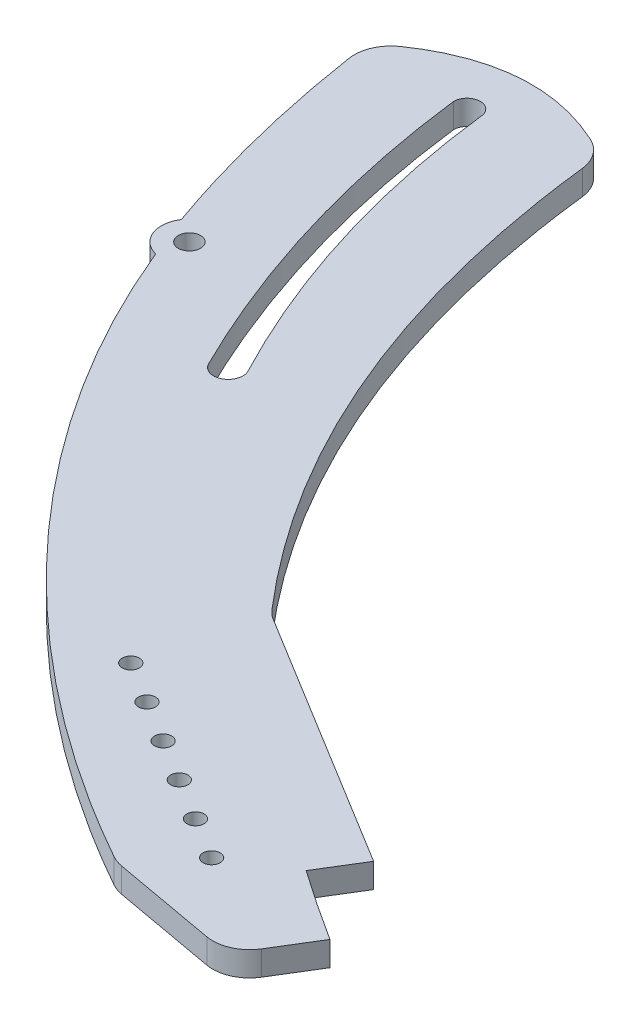
ISO-10303-21;
HEADER;
FILE_DESCRIPTION(('STEP AP214'),'2;1');
FILE_NAME('part.step','',(''),(''),'','','');
FILE_SCHEMA(('AUTOMOTIVE_DESIGN { 1 0 10303 214 1 1 1 1 }'));
ENDSEC;
DATA;
#1=APPLICATION_CONTEXT('core data for automotive mechanical design processes');
#2=APPLICATION_PROTOCOL_DEFINITION('international standard','automotive_design',2000,#1);
#3=PRODUCT_CONTEXT('',#1,'mechanical');
#4=PRODUCT('Part','Part','',(#3));
#5=PRODUCT_RELATED_PRODUCT_CATEGORY('part','',(#4));
#6=PRODUCT_DEFINITION_FORMATION('','',#4);
#7=PRODUCT_DEFINITION_CONTEXT('part definition',#1,'design');
#8=PRODUCT_DEFINITION('design','',#6,#7);
#9=PRODUCT_DEFINITION_SHAPE('','',#8);
#10=(LENGTH_UNIT() NAMED_UNIT(*) SI_UNIT(.MILLI.,.METRE.));
#11=(NAMED_UNIT(*) PLANE_ANGLE_UNIT() SI_UNIT($,.RADIAN.));
#12=(NAMED_UNIT(*) SI_UNIT($,.STERADIAN.) SOLID_ANGLE_UNIT());
#13=UNCERTAINTY_MEASURE_WITH_UNIT(LENGTH_MEASURE(1.E-05),#10,'distance_accuracy_value','');
#14=(GEOMETRIC_REPRESENTATION_CONTEXT(3) GLOBAL_UNCERTAINTY_ASSIGNED_CONTEXT((#13)) GLOBAL_UNIT_ASSIGNED_CONTEXT((#10,
#11,#12)) REPRESENTATION_CONTEXT('',''));
#15=CARTESIAN_POINT('',(0.,0.,0.));
#16=DIRECTION('',(0.,0.,1.));
#17=DIRECTION('',(1.,0.,0.));
#18=AXIS2_PLACEMENT_3D('',#15,#16,#17);
#19=CARTESIAN_POINT('',(-112.504808467415,10.0000000000053,-77.6016572357279));
#20=DIRECTION('',(0.,0.999999999999967,0.));
#21=DIRECTION('',(0.,0.,1.));
#22=AXIS2_PLACEMENT_3D('',#19,#20,#21);
#23=CYLINDRICAL_SURFACE('',#22,11.9494694656182);
#24=DIRECTION('',(0.,0.999999999999967,0.));
#25=VECTOR('',#24,1.);
#26=CARTESIAN_POINT('',(-101.578819558646,10.0000000000054,-82.4403127179051));
#27=LINE('',#26,#25);
#28=CARTESIAN_POINT('',(-101.578819558654,-9.9999999999939,-82.4403127179124));
#29=VERTEX_POINT('',#28);
#30=CARTESIAN_POINT('',(-101.578819558646,10.0000000000054,-82.4403127179051));
#31=VERTEX_POINT('',#30);
#32=EDGE_CURVE('E11',#29,#31,#27,.T.);
#33=ORIENTED_EDGE('',*,*,#32,.F.);
#34=CARTESIAN_POINT('',(-112.504808467415,-9.99999999999271,-77.6016572357279));
#35=DIRECTION('',(0.,0.999999999999967,0.));
#36=DIRECTION('',(0.,0.,1.));
#37=AXIS2_PLACEMENT_3D('',#34,#35,#36);
#38=CIRCLE('',#37,11.9494694656182);
#39=CARTESIAN_POINT('',(-122.767847636197,-9.9999999999939,-71.4812121922836));
#40=VERTEX_POINT('',#39);
#41=EDGE_CURVE('E141',#40,#29,#38,.T.);
#42=ORIENTED_EDGE('',*,*,#41,.F.);
#43=DIRECTION('',(0.,0.999999999999967,0.));
#44=VECTOR('',#43,1.);
#45=CARTESIAN_POINT('',(-122.76784763619,10.0000000000027,-71.481212192276));
#46=LINE('',#45,#44);
#47=CARTESIAN_POINT('',(-122.76784763619,10.0000000000027,-71.481212192276));
#48=VERTEX_POINT('',#47);
#49=EDGE_CURVE('E49',#40,#48,#46,.T.);
#50=ORIENTED_EDGE('',*,*,#49,.T.);
#51=CARTESIAN_POINT('',(-112.504808467415,10.0000000000053,-77.6016572357279));
#52=DIRECTION('',(0.,0.999999999999967,0.));
#53=DIRECTION('',(0.,0.,0.999999999999989));
#54=AXIS2_PLACEMENT_3D('',#51,#52,#53);
#55=CIRCLE('',#54,11.9494694656182);
#56=EDGE_CURVE('E215',#48,#31,#55,.T.);
#57=ORIENTED_EDGE('',*,*,#56,.T.);
#58=EDGE_LOOP('',(#33,#42,#50,#57));
#59=FACE_BOUND('',#58,.T.);
#60=ADVANCED_FACE('F39',(#59),#23,.F.);
#61=CARTESIAN_POINT('',(-208.515206524534,10.0000000000054,-357.327547054675));
#62=CARTESIAN_POINT('',(-190.190260855295,10.0000000000054,-206.954433805337));
#63=CARTESIAN_POINT('',(-122.76784763619,10.0000000000027,-71.481212192276));
#64=B_SPLINE_CURVE_WITH_KNOTS('',2,(#61,#62,#63),.UNSPECIFIED.,.F.,.F.,(3,3),(0.,1.),.UNSPECIFIED.);
#65=DIRECTION('',(0.,0.999999999999967,0.));
#66=VECTOR('',#65,1.);
#67=SURFACE_OF_LINEAR_EXTRUSION('',#64,#66);
#68=ORIENTED_EDGE('',*,*,#49,.F.);
#69=CARTESIAN_POINT('',(-208.515206524534,-9.9999999999926,-357.327547054675));
#70=CARTESIAN_POINT('',(-190.190260855295,-9.9999999999926,-206.954433805337));
#71=CARTESIAN_POINT('',(-122.76784763619,-9.99999999999537,-71.481212192276));
#72=B_SPLINE_CURVE_WITH_KNOTS('',2,(#69,#70,#71),.UNSPECIFIED.,.F.,.F.,(3,3),(0.,1.),.UNSPECIFIED.);
#73=CARTESIAN_POINT('',(-208.515206524533,-9.9999999999939,-357.327547054676));
#74=VERTEX_POINT('',#73);
#75=EDGE_CURVE('E151',#74,#40,#72,.T.);
#76=ORIENTED_EDGE('',*,*,#75,.F.);
#77=DIRECTION('',(0.,0.999999999999967,0.));
#78=VECTOR('',#77,1.);
#79=CARTESIAN_POINT('',(-208.515206524534,10.0000000000054,-357.327547054675));
#80=LINE('',#79,#78);
#81=CARTESIAN_POINT('',(-208.515206524534,10.0000000000054,-357.327547054675));
#82=VERTEX_POINT('',#81);
#83=EDGE_CURVE('E57',#74,#82,#80,.T.);
#84=ORIENTED_EDGE('',*,*,#83,.T.);
#85=EDGE_CURVE('E220',#82,#48,#64,.T.);
#86=ORIENTED_EDGE('',*,*,#85,.T.);
#87=EDGE_LOOP('',(#68,#76,#84,#86));
#88=FACE_BOUND('',#87,.T.);
#89=ADVANCED_FACE('F222',(#88),#67,.F.);
#90=CARTESIAN_POINT('',(-197.655507989394,10.0000000000054,-357.327547054675));
#91=DIRECTION('',(0.,0.999999999999967,0.));
#92=DIRECTION('',(0.,0.,1.));
#93=AXIS2_PLACEMENT_3D('',#90,#91,#92);
#94=CYLINDRICAL_SURFACE('',#93,10.8596985351393);
#95=ORIENTED_EDGE('',*,*,#83,.F.);
#96=CARTESIAN_POINT('',(-197.655507989394,-9.9999999999926,-357.327547054675));
#97=DIRECTION('',(0.,0.999999999999967,0.));
#98=DIRECTION('',(0.,0.,1.));
#99=AXIS2_PLACEMENT_3D('',#96,#97,#98);
#100=CIRCLE('',#99,10.8596985351393);
#101=CARTESIAN_POINT('',(-187.064969533198,-9.9999999999939,-359.730367789132));
#102=VERTEX_POINT('',#101);
#103=EDGE_CURVE('E140',#102,#74,#100,.T.);
#104=ORIENTED_EDGE('',*,*,#103,.F.);
#105=DIRECTION('',(0.,0.999999999999967,0.));
#106=VECTOR('',#105,1.);
#107=CARTESIAN_POINT('',(-187.064969533197,10.0000000000054,-359.730367789131));
#108=LINE('',#107,#106);
#109=CARTESIAN_POINT('',(-187.064969533197,10.0000000000054,-359.730367789131));
#110=VERTEX_POINT('',#109);
#111=EDGE_CURVE('E43',#102,#110,#108,.T.);
#112=ORIENTED_EDGE('',*,*,#111,.T.);
#113=CARTESIAN_POINT('',(-197.655507989394,10.0000000000054,-357.327547054675));
#114=DIRECTION('',(0.,0.999999999999967,0.));
#115=DIRECTION('',(0.,0.,0.999999999999989));
#116=AXIS2_PLACEMENT_3D('',#113,#114,#115);
#117=CIRCLE('',#116,10.8596985351393);
#118=EDGE_CURVE('E246',#110,#82,#117,.T.);
#119=ORIENTED_EDGE('',*,*,#118,.T.);
#120=EDGE_LOOP('',(#95,#104,#112,#119));
#121=FACE_BOUND('',#120,.T.);
#122=ADVANCED_FACE('F143',(#121),#94,.F.);
#123=CARTESIAN_POINT('',(-284.166993354968,10.0000000000054,-362.846966077963));
#124=CARTESIAN_POINT('',(-269.08851588887,10.0000000000054,-254.098846988916));
#125=CARTESIAN_POINT('',(-234.484122525879,10.0000000000054,-158.515794454264));
#126=B_SPLINE_CURVE_WITH_KNOTS('',2,(#123,#124,#125),.UNSPECIFIED.,.F.,.F.,(3,3),(0.,
0.237297417163311),.UNSPECIFIED.);
#127=DIRECTION('',(0.,0.999999999999967,0.));
#128=VECTOR('',#127,1.);
#129=SURFACE_OF_LINEAR_EXTRUSION('',#126,#128);
#130=DIRECTION('',(0.,0.999999999999967,0.));
#131=VECTOR('',#130,1.);
#132=CARTESIAN_POINT('',(-281.56631648904,10.0000000000054,-345.123298514601));
#133=LINE('',#132,#131);
#134=CARTESIAN_POINT('',(-281.566316489033,-9.9999999999939,-345.123298514602));
#135=VERTEX_POINT('',#134);
#136=CARTESIAN_POINT('',(-281.56631648904,10.0000000000054,-345.123298514601));
#137=VERTEX_POINT('',#136);
#138=EDGE_CURVE('E134',#135,#137,#133,.T.);
#139=ORIENTED_EDGE('',*,*,#138,.F.);
#140=CARTESIAN_POINT('',(-284.166993354968,-9.9999999999926,-362.846966077963));
#141=CARTESIAN_POINT('',(-269.08851588887,-9.9999999999926,-254.098846988916));
#142=CARTESIAN_POINT('',(-234.484122525879,-9.9999999999926,-158.515794454264));
#143=B_SPLINE_CURVE_WITH_KNOTS('',2,(#140,#141,#142),.UNSPECIFIED.,.F.,.F.,(3,3),(0.,
0.237297417163311),.UNSPECIFIED.);
#144=CARTESIAN_POINT('',(-236.052988817462,-9.9999999999939,-162.884190394736));
#145=VERTEX_POINT('',#144);
#146=EDGE_CURVE('E391',#135,#145,#143,.T.);
#147=ORIENTED_EDGE('',*,*,#146,.T.);
#148=DIRECTION('',(0.,0.999999999999967,0.));
#149=VECTOR('',#148,1.);
#150=CARTESIAN_POINT('',(-236.052988817465,10.0000000000054,-162.88419039473));
#151=LINE('',#150,#149);
#152=CARTESIAN_POINT('',(-236.052988817465,10.0000000000054,-162.88419039473));
#153=VERTEX_POINT('',#152);
#154=EDGE_CURVE('E205',#145,#153,#151,.T.);
#155=ORIENTED_EDGE('',*,*,#154,.T.);
#156=EDGE_CURVE('E449',#137,#153,#126,.T.);
#157=ORIENTED_EDGE('',*,*,#156,.F.);
#158=EDGE_LOOP('',(#139,#147,#155,#157));
#159=FACE_BOUND('',#158,.T.);
#160=ADVANCED_FACE('F442',(#159),#129,.T.);
#161=CARTESIAN_POINT('',(-216.975991272819,10.0000000000054,-150.401023866531));
#162=DIRECTION('',(0.,0.999999999999967,0.));
#163=DIRECTION('',(0.,0.,1.));
#164=AXIS2_PLACEMENT_3D('',#161,#162,#163);
#165=CYLINDRICAL_SURFACE('',#164,22.7982736602824);
#166=ORIENTED_EDGE('',*,*,#154,.F.);
#167=CARTESIAN_POINT('',(-216.975991272819,-9.9999999999926,-150.401023866531));
#168=DIRECTION('',(0.,0.999999999999967,0.));
#169=DIRECTION('',(0.,0.,1.));
#170=AXIS2_PLACEMENT_3D('',#167,#168,#169);
#171=CIRCLE('',#170,22.7982736602824);
#172=CARTESIAN_POINT('',(-222.252668018453,-9.9999999999939,-128.221800155795));
#173=VERTEX_POINT('',#172);
#174=EDGE_CURVE('E393',#145,#173,#171,.T.);
#175=ORIENTED_EDGE('',*,*,#174,.T.);
#176=DIRECTION('',(0.,0.999999999999967,0.));
#177=VECTOR('',#176,1.);
#178=CARTESIAN_POINT('',(-222.252668018455,10.0000000000054,-128.221800155788));
#179=LINE('',#178,#177);
#180=CARTESIAN_POINT('',(-222.252668018455,10.0000000000054,-128.221800155788));
#181=VERTEX_POINT('',#180);
#182=EDGE_CURVE('E202',#173,#181,#179,.T.);
#183=ORIENTED_EDGE('',*,*,#182,.T.);
#184=CARTESIAN_POINT('',(-216.975991272819,10.0000000000054,-150.401023866531));
#185=DIRECTION('',(0.,0.999999999999967,0.));
#186=DIRECTION('',(0.,0.,0.999999999999989));
#187=AXIS2_PLACEMENT_3D('',#184,#185,#186);
#188=CIRCLE('',#187,22.7982736602824);
#189=EDGE_CURVE('E456',#153,#181,#188,.T.);
#190=ORIENTED_EDGE('',*,*,#189,.F.);
#191=EDGE_LOOP('',(#166,#175,#183,#190));
#192=FACE_BOUND('',#191,.T.);
#193=ADVANCED_FACE('F446',(#192),#165,.T.);
#194=CARTESIAN_POINT('',(-224.911358003155,10.0000000000054,-134.781794450253));
#195=CARTESIAN_POINT('',(-148.296178403796,10.0000000000027,56.7706965681401));
#196=CARTESIAN_POINT('',(3.04877842697027,10.,212.66768562893));
#197=CARTESIAN_POINT('',(190.990624601572,10.0000000000054,316.925575497295));
#198=B_SPLINE_CURVE_WITH_KNOTS('',3,(#194,#195,#196,#197),.UNSPECIFIED.,.F.,.F.,(4,4),
(0.272003714923231,1.),.UNSPECIFIED.);
#199=DIRECTION('',(0.,0.999999999999967,0.));
#200=VECTOR('',#199,1.);
#201=SURFACE_OF_LINEAR_EXTRUSION('',#198,#200);
#202=ORIENTED_EDGE('',*,*,#182,.F.);
#203=CARTESIAN_POINT('',(-224.911358003155,-9.9999999999926,-134.781794450253));
#204=CARTESIAN_POINT('',(-148.296178403796,-9.99999999999538,56.7706965681401));
#205=CARTESIAN_POINT('',(3.04877842697027,-9.99999999999804,212.66768562893));
#206=CARTESIAN_POINT('',(190.990624601572,-9.9999999999926,316.925575497295));
#207=B_SPLINE_CURVE_WITH_KNOTS('',3,(#203,#204,#205,#206),.UNSPECIFIED.,.F.,.F.,(4,4),
(0.272003714923231,1.),.UNSPECIFIED.);
#208=CARTESIAN_POINT('',(186.559677270722,-9.9999999999939,314.454201999797));
#209=VERTEX_POINT('',#208);
#210=EDGE_CURVE('E512',#173,#209,#207,.T.);
#211=ORIENTED_EDGE('',*,*,#210,.T.);
#212=DIRECTION('',(0.,0.999999999999967,0.));
#213=VECTOR('',#212,1.);
#214=CARTESIAN_POINT('',(186.559677270757,10.0000000000054,314.454201999813));
#215=LINE('',#214,#213);
#216=CARTESIAN_POINT('',(186.559677270757,10.0000000000054,314.454201999813));
#217=VERTEX_POINT('',#216);
#218=EDGE_CURVE('E199',#209,#217,#215,.T.);
#219=ORIENTED_EDGE('',*,*,#218,.T.);
#220=EDGE_CURVE('E463',#181,#217,#198,.T.);
#221=ORIENTED_EDGE('',*,*,#220,.F.);
#222=EDGE_LOOP('',(#202,#211,#219,#221));
#223=FACE_BOUND('',#222,.T.);
#224=ADVANCED_FACE('F474',(#223),#201,.T.);
#225=CARTESIAN_POINT('',(201.233328198938,10.0000000000054,288.287735512382));
#226=DIRECTION('',(0.,0.999999999999967,0.));
#227=DIRECTION('',(0.,0.,1.));
#228=AXIS2_PLACEMENT_3D('',#225,#226,#227);
#229=CYLINDRICAL_SURFACE('',#228,30.);
#230=ORIENTED_EDGE('',*,*,#218,.F.);
#231=CARTESIAN_POINT('',(201.233328198938,-9.9999999999926,288.287735512382));
#232=DIRECTION('',(0.,0.999999999999967,0.));
#233=DIRECTION('',(0.,0.,1.));
#234=AXIS2_PLACEMENT_3D('',#231,#232,#233);
#235=CIRCLE('',#234,30.);
#236=CARTESIAN_POINT('',(195.915259395917,-9.9999999999939,317.812608826346));
#237=VERTEX_POINT('',#236);
#238=EDGE_CURVE('E510',#209,#237,#235,.T.);
#239=ORIENTED_EDGE('',*,*,#238,.T.);
#240=DIRECTION('',(0.,0.999999999999967,0.));
#241=VECTOR('',#240,1.);
#242=CARTESIAN_POINT('',(195.915259395952,10.0000000000054,317.812608826363));
#243=LINE('',#242,#241);
#244=CARTESIAN_POINT('',(195.915259395952,10.0000000000054,317.812608826363));
#245=VERTEX_POINT('',#244);
#246=EDGE_CURVE('E196',#237,#245,#243,.T.);
#247=ORIENTED_EDGE('',*,*,#246,.T.);
#248=CARTESIAN_POINT('',(201.233328198938,10.0000000000054,288.287735512382));
#249=DIRECTION('',(0.,0.999999999999967,0.));
#250=DIRECTION('',(0.,0.,0.999999999999989));
#251=AXIS2_PLACEMENT_3D('',#248,#249,#250);
#252=CIRCLE('',#251,30.);
#253=EDGE_CURVE('E469',#217,#245,#252,.T.);
#254=ORIENTED_EDGE('',*,*,#253,.F.);
#255=EDGE_LOOP('',(#230,#239,#247,#254));
#256=FACE_BOUND('',#255,.T.);
#257=ADVANCED_FACE('F477',(#256),#229,.T.);
#258=CARTESIAN_POINT('',(190.990624601572,10.0000000000054,316.925575497295));
#259=DIRECTION('',(-0.177268960099479,0.,0.984162443799422));
#260=DIRECTION('',(0.984162443799442,0.,0.177268960099483));
#261=AXIS2_PLACEMENT_3D('',#258,#259,#260);
#262=PLANE('',#261);
#263=ORIENTED_EDGE('',*,*,#246,.F.);
#264=DIRECTION('',(0.984162443799442,0.,0.177268960099483));
#265=VECTOR('',#264,1.);
#266=CARTESIAN_POINT('',(190.990624601572,-9.9999999999926,316.925575497295));
#267=LINE('',#266,#265);
#268=CARTESIAN_POINT('',(280.682136322799,-9.9999999999939,333.08095829282));
#269=VERTEX_POINT('',#268);
#270=EDGE_CURVE('E504',#237,#269,#267,.T.);
#271=ORIENTED_EDGE('',*,*,#270,.T.);
#272=DIRECTION('',(0.,0.999999999999967,0.));
#273=VECTOR('',#272,1.);
#274=CARTESIAN_POINT('',(280.682136322841,10.0000000000054,333.080958292837));
#275=LINE('',#274,#273);
#276=CARTESIAN_POINT('',(280.682136322841,10.0000000000054,333.080958292837));
#277=VERTEX_POINT('',#276);
#278=EDGE_CURVE('E193',#269,#277,#275,.T.);
#279=ORIENTED_EDGE('',*,*,#278,.T.);
#280=DIRECTION('',(0.984162443799442,0.,0.177268960099483));
#281=VECTOR('',#280,1.);
#282=CARTESIAN_POINT('',(190.990624601572,10.0000000000054,316.925575497295));
#283=LINE('',#282,#281);
#284=EDGE_CURVE('E847',#245,#277,#283,.T.);
#285=ORIENTED_EDGE('',*,*,#284,.F.);
#286=EDGE_LOOP('',(#263,#271,#279,#285));
#287=FACE_BOUND('',#286,.T.);
#288=ADVANCED_FACE('F481',(#287),#262,.T.);
#289=CARTESIAN_POINT('',(286.000205125826,10.0000000000054,303.556084978855));
#290=DIRECTION('',(0.,0.999999999999967,0.));
#291=DIRECTION('',(0.,0.,1.));
#292=AXIS2_PLACEMENT_3D('',#289,#290,#291);
#293=CYLINDRICAL_SURFACE('',#292,30.);
#294=ORIENTED_EDGE('',*,*,#278,.F.);
#295=CARTESIAN_POINT('',(286.000205125826,-9.9999999999926,303.556084978855));
#296=DIRECTION('',(0.,0.999999999999967,0.));
#297=DIRECTION('',(0.,0.,1.));
#298=AXIS2_PLACEMENT_3D('',#295,#296,#297);
#299=CIRCLE('',#298,30.);
#300=CARTESIAN_POINT('',(311.571961877621,-9.9999999999939,319.243189766685));
#301=VERTEX_POINT('',#300);
#302=EDGE_CURVE('E495',#269,#301,#299,.T.);
#303=ORIENTED_EDGE('',*,*,#302,.T.);
#304=DIRECTION('',(0.,0.999999999999967,0.));
#305=VECTOR('',#304,1.);
#306=CARTESIAN_POINT('',(311.571961877666,10.0000000000054,319.243189766702));
#307=LINE('',#306,#305);
#308=CARTESIAN_POINT('',(311.571961877666,10.0000000000054,319.243189766702));
#309=VERTEX_POINT('',#308);
#310=EDGE_CURVE('E190',#301,#309,#307,.T.);
#311=ORIENTED_EDGE('',*,*,#310,.T.);
#312=CARTESIAN_POINT('',(286.000205125826,10.0000000000054,303.556084978855));
#313=DIRECTION('',(0.,0.999999999999967,0.));
#314=DIRECTION('',(0.,0.,0.999999999999989));
#315=AXIS2_PLACEMENT_3D('',#312,#313,#314);
#316=CIRCLE('',#315,30.);
#317=EDGE_CURVE('E497',#277,#309,#316,.T.);
#318=ORIENTED_EDGE('',*,*,#317,.F.);
#319=EDGE_LOOP('',(#294,#303,#311,#318));
#320=FACE_BOUND('',#319,.T.);
#321=ADVANCED_FACE('F484',(#320),#293,.T.);
#322=CARTESIAN_POINT('',(355.898409693688,10.0000000000052,246.986061599702));
#323=DIRECTION('',(-0.852391891727947,0.,-0.522903492928143));
#324=DIRECTION('',(-0.522903492928138,0.,0.852391891727938));
#325=AXIS2_PLACEMENT_3D('',#322,#323,#324);
#326=PLANE('',#325);
#327=ORIENTED_EDGE('',*,*,#310,.F.);
#328=DIRECTION('',(-0.522903492928138,0.,0.852391891727938));
#329=VECTOR('',#328,1.);
#330=CARTESIAN_POINT('',(355.898409693688,-9.99999999999282,246.986061599702));
#331=LINE('',#330,#329);
#332=CARTESIAN_POINT('',(332.725450547143,-9.9999999999939,284.760608434726));
#333=VERTEX_POINT('',#332);
#334=EDGE_CURVE('E508',#333,#301,#331,.T.);
#335=ORIENTED_EDGE('',*,*,#334,.F.);
#336=DIRECTION('',(0.,0.999999999999967,0.));
#337=VECTOR('',#336,1.);
#338=CARTESIAN_POINT('',(332.72545054719,10.0000000000109,284.760608434742));
#339=LINE('',#338,#337);
#340=CARTESIAN_POINT('',(332.72545054719,10.0000000000109,284.760608434742));
#341=VERTEX_POINT('',#340);
#342=EDGE_CURVE('E187',#333,#341,#339,.T.);
#343=ORIENTED_EDGE('',*,*,#342,.T.);
#344=DIRECTION('',(-0.522903492928138,0.,0.852391891727938));
#345=VECTOR('',#344,1.);
#346=CARTESIAN_POINT('',(355.898409693688,10.0000000000052,246.986061599702));
#347=LINE('',#346,#345);
#348=EDGE_CURVE('E318',#341,#309,#347,.T.);
#349=ORIENTED_EDGE('',*,*,#348,.T.);
#350=EDGE_LOOP('',(#327,#335,#343,#349));
#351=FACE_BOUND('',#350,.T.);
#352=ADVANCED_FACE('F307',(#351),#326,.F.);
#353=CARTESIAN_POINT('',(452.509506655077,10.0000000000054,353.179328963177));
#354=CARTESIAN_POINT('',(342.931545230282,10.0000000000109,297.091661674833));
#355=CARTESIAN_POINT('',(244.030822640259,10.,223.963827781718));
#356=B_SPLINE_CURVE_WITH_KNOTS('',2,(#353,#354,#355),.UNSPECIFIED.,.F.,.F.,(3,3),(0.,1.),.UNSPECIFIED.);
#357=DIRECTION('',(0.,0.999999999999967,0.));
#358=VECTOR('',#357,1.);
#359=SURFACE_OF_LINEAR_EXTRUSION('',#356,#358);
#360=ORIENTED_EDGE('',*,*,#342,.F.);
#361=CARTESIAN_POINT('',(452.509506655077,-9.9999999999926,353.179328963177));
#362=CARTESIAN_POINT('',(342.931545230282,-9.99999999998716,297.091661674833));
#363=CARTESIAN_POINT('',(244.030822640259,-9.99999999999804,223.963827781718));
#364=B_SPLINE_CURVE_WITH_KNOTS('',2,(#361,#362,#363),.UNSPECIFIED.,.F.,.F.,(3,3),(0.,1.),.UNSPECIFIED.);
#365=CARTESIAN_POINT('',(274.455334494156,-9.9999999999939,245.879580059086));
#366=VERTEX_POINT('',#365);
#367=EDGE_CURVE('E852',#333,#366,#364,.T.);
#368=ORIENTED_EDGE('',*,*,#367,.T.);
#369=DIRECTION('',(0.,0.999999999999967,0.));
#370=VECTOR('',#369,1.);
#371=CARTESIAN_POINT('',(274.455334494198,10.0000000000054,245.879580059101));
#372=LINE('',#371,#370);
#373=CARTESIAN_POINT('',(274.455334494198,10.0000000000054,245.879580059101));
#374=VERTEX_POINT('',#373);
#375=EDGE_CURVE('E184',#366,#374,#372,.T.);
#376=ORIENTED_EDGE('',*,*,#375,.T.);
#377=EDGE_CURVE('E310',#341,#374,#356,.T.);
#378=ORIENTED_EDGE('',*,*,#377,.F.);
#379=EDGE_LOOP('',(#360,#368,#376,#378));
#380=FACE_BOUND('',#379,.T.);
#381=ADVANCED_FACE('F302',(#380),#359,.T.);
#382=CARTESIAN_POINT('',(295.371474211218,10.,211.783904389922));
#383=DIRECTION('',(-0.85239189172956,0.,-0.522903492925514));
#384=DIRECTION('',(-0.522903492925507,0.,0.852391891729548));
#385=AXIS2_PLACEMENT_3D('',#382,#383,#384);
#386=PLANE('',#385);
#387=ORIENTED_EDGE('',*,*,#375,.F.);
#388=DIRECTION('',(-0.522903492925507,0.,0.852391891729548));
#389=VECTOR('',#388,1.);
#390=CARTESIAN_POINT('',(295.371474211218,-9.99999999999804,211.783904389922));
#391=LINE('',#390,#389);
#392=CARTESIAN_POINT('',(295.371474211175,-9.9999999999939,211.783904389908));
#393=VERTEX_POINT('',#392);
#394=EDGE_CURVE('E855',#393,#366,#391,.T.);
#395=ORIENTED_EDGE('',*,*,#394,.F.);
#396=DIRECTION('',(0.,0.999999999999967,0.));
#397=VECTOR('',#396,1.);
#398=CARTESIAN_POINT('',(295.371474211218,10.0000000000001,211.783904389922));
#399=LINE('',#398,#397);
#400=CARTESIAN_POINT('',(295.371474211218,10.0000000000001,211.783904389922));
#401=VERTEX_POINT('',#400);
#402=EDGE_CURVE('E181',#393,#401,#399,.T.);
#403=ORIENTED_EDGE('',*,*,#402,.T.);
#404=DIRECTION('',(-0.522903492925507,0.,0.852391891729548));
#405=VECTOR('',#404,1.);
#406=CARTESIAN_POINT('',(295.371474211218,10.,211.783904389922));
#407=LINE('',#406,#405);
#408=EDGE_CURVE('E317',#401,#374,#407,.T.);
#409=ORIENTED_EDGE('',*,*,#408,.T.);
#410=EDGE_LOOP('',(#387,#395,#403,#409));
#411=FACE_BOUND('',#410,.T.);
#412=ADVANCED_FACE('F298',(#411),#386,.F.);
#413=CARTESIAN_POINT('',(79.5865804657254,10.0000000000054,79.4097279628086));
#414=DIRECTION('',(-0.522903492928109,0.,0.852391891727967));
#415=DIRECTION('',(0.852391891727982,0.,0.522903492928118));
#416=AXIS2_PLACEMENT_3D('',#413,#414,#415);
#417=PLANE('',#416);
#418=ORIENTED_EDGE('',*,*,#402,.F.);
#419=DIRECTION('',(0.852391891727982,0.,0.522903492928118));
#420=VECTOR('',#419,1.);
#421=CARTESIAN_POINT('',(79.5865804657254,-9.9999999999926,79.4097279628086));
#422=LINE('',#421,#420);
#423=CARTESIAN_POINT('',(83.5275258202743,-9.9999999999939,81.8273179367806));
#424=VERTEX_POINT('',#423);
#425=EDGE_CURVE('E859',#424,#393,#422,.T.);
#426=ORIENTED_EDGE('',*,*,#425,.F.);
#427=DIRECTION('',(0.,0.999999999999967,0.));
#428=VECTOR('',#427,1.);
#429=CARTESIAN_POINT('',(83.5275258202993,10.0000000000054,81.8273179367916));
#430=LINE('',#429,#428);
#431=CARTESIAN_POINT('',(83.5275258202993,10.0000000000054,81.8273179367916));
#432=VERTEX_POINT('',#431);
#433=EDGE_CURVE('E178',#424,#432,#430,.T.);
#434=ORIENTED_EDGE('',*,*,#433,.T.);
#435=DIRECTION('',(0.852391891727982,0.,0.522903492928118));
#436=VECTOR('',#435,1.);
#437=CARTESIAN_POINT('',(79.5865804657254,10.0000000000054,79.4097279628086));
#438=LINE('',#437,#436);
#439=EDGE_CURVE('E324',#432,#401,#438,.T.);
#440=ORIENTED_EDGE('',*,*,#439,.T.);
#441=EDGE_LOOP('',(#418,#426,#434,#440));
#442=FACE_BOUND('',#441,.T.);
#443=ADVANCED_FACE('F294',(#442),#417,.F.);
#444=CARTESIAN_POINT('',(99.2146306081431,10.0000000000054,56.2555611849529));
#445=DIRECTION('',(0.,0.999999999999967,0.));
#446=DIRECTION('',(0.,0.,1.));
#447=AXIS2_PLACEMENT_3D('',#444,#445,#446);
#448=CYLINDRICAL_SURFACE('',#447,30.);
#449=ORIENTED_EDGE('',*,*,#433,.F.);
#450=CARTESIAN_POINT('',(99.2146306081431,-9.9999999999926,56.2555611849529));
#451=DIRECTION('',(0.,0.999999999999967,0.));
#452=DIRECTION('',(0.,0.,1.));
#453=AXIS2_PLACEMENT_3D('',#450,#451,#452);
#454=CIRCLE('',#453,30.);
#455=CARTESIAN_POINT('',(76.4964207337627,-9.9999999999939,75.848492055657));
#456=VERTEX_POINT('',#455);
#457=EDGE_CURVE('E861',#424,#456,#454,.F.);
#458=ORIENTED_EDGE('',*,*,#457,.T.);
#459=DIRECTION('',(0.,0.999999999999967,0.));
#460=VECTOR('',#459,1.);
#461=CARTESIAN_POINT('',(76.4964207337871,10.0000000000054,75.8484920556679));
#462=LINE('',#461,#460);
#463=CARTESIAN_POINT('',(76.4964207337871,10.0000000000054,75.8484920556679));
#464=VERTEX_POINT('',#463);
#465=EDGE_CURVE('E175',#456,#464,#462,.T.);
#466=ORIENTED_EDGE('',*,*,#465,.T.);
#467=CARTESIAN_POINT('',(99.2146306081431,10.0000000000054,56.2555611849529));
#468=DIRECTION('',(0.,0.999999999999967,0.));
#469=DIRECTION('',(0.,0.,0.999999999999989));
#470=AXIS2_PLACEMENT_3D('',#467,#468,#469);
#471=CIRCLE('',#470,30.);
#472=EDGE_CURVE('E278',#432,#464,#471,.F.);
#473=ORIENTED_EDGE('',*,*,#472,.F.);
#474=EDGE_LOOP('',(#449,#458,#466,#473));
#475=FACE_BOUND('',#474,.T.);
#476=ADVANCED_FACE('F289',(#475),#448,.F.);
#477=CARTESIAN_POINT('',(244.030822640259,10.,223.963827781718));
#478=CARTESIAN_POINT('',(-72.3320165645925,10.0000000000054,7.95149791119762));
#479=CARTESIAN_POINT('',(-110.383668160186,10.0000000000054,-378.280020194991));
#480=B_SPLINE_CURVE_WITH_KNOTS('',2,(#477,#478,#479),.UNSPECIFIED.,.F.,.F.,(3,3),(0.,1.),.UNSPECIFIED.);
#481=DIRECTION('',(0.,0.999999999999967,0.));
#482=VECTOR('',#481,1.);
#483=SURFACE_OF_LINEAR_EXTRUSION('',#480,#482);
#484=ORIENTED_EDGE('',*,*,#465,.F.);
#485=CARTESIAN_POINT('',(244.030822640259,-9.99999999999804,223.963827781718));
#486=CARTESIAN_POINT('',(-72.3320165645925,-9.9999999999926,7.95149791119762));
#487=CARTESIAN_POINT('',(-110.383668160186,-9.9999999999926,-378.280020194991));
#488=B_SPLINE_CURVE_WITH_KNOTS('',2,(#485,#486,#487),.UNSPECIFIED.,.F.,.F.,(3,3),(0.,1.),.UNSPECIFIED.);
#489=CARTESIAN_POINT('',(-108.698028994468,-9.9999999999939,-362.441203032319));
#490=VERTEX_POINT('',#489);
#491=EDGE_CURVE('E342',#456,#490,#488,.T.);
#492=ORIENTED_EDGE('',*,*,#491,.T.);
#493=DIRECTION('',(0.,0.999999999999967,0.));
#494=VECTOR('',#493,1.);
#495=CARTESIAN_POINT('',(-108.69802899446,10.0000000000054,-362.441203032319));
#496=LINE('',#495,#494);
#497=CARTESIAN_POINT('',(-108.69802899446,10.0000000000054,-362.441203032319));
#498=VERTEX_POINT('',#497);
#499=EDGE_CURVE('E171',#490,#498,#496,.T.);
#500=ORIENTED_EDGE('',*,*,#499,.T.);
#501=EDGE_CURVE('E272',#464,#498,#480,.T.);
#502=ORIENTED_EDGE('',*,*,#501,.F.);
#503=EDGE_LOOP('',(#484,#492,#500,#502));
#504=FACE_BOUND('',#503,.T.);
#505=ADVANCED_FACE('F284',(#504),#483,.T.);
#506=CARTESIAN_POINT('',(-138.503620613499,10.0000000000054,-359.031407108975));
#507=DIRECTION('',(0.,0.999999999999967,0.));
#508=DIRECTION('',(0.,0.,1.));
#509=AXIS2_PLACEMENT_3D('',#506,#507,#508);
#510=CYLINDRICAL_SURFACE('',#509,30.);
#511=ORIENTED_EDGE('',*,*,#499,.F.);
#512=CARTESIAN_POINT('',(-138.503620613499,-9.9999999999926,-359.031407108975));
#513=DIRECTION('',(0.,0.999999999999967,0.));
#514=DIRECTION('',(0.,0.,1.));
#515=AXIS2_PLACEMENT_3D('',#512,#513,#514);
#516=CIRCLE('',#515,30.);
#517=CARTESIAN_POINT('',(-125.944040496132,-9.9999999999939,-386.275800060097));
#518=VERTEX_POINT('',#517);
#519=EDGE_CURVE('E348',#490,#518,#516,.T.);
#520=ORIENTED_EDGE('',*,*,#519,.T.);
#521=DIRECTION('',(0.,0.999999999999967,0.));
#522=VECTOR('',#521,1.);
#523=CARTESIAN_POINT('',(-125.944040496126,10.0000000000054,-386.275800060097));
#524=LINE('',#523,#522);
#525=CARTESIAN_POINT('',(-125.944040496126,10.0000000000054,-386.275800060097));
#526=VERTEX_POINT('',#525);
#527=EDGE_CURVE('E168',#518,#526,#524,.T.);
#528=ORIENTED_EDGE('',*,*,#527,.T.);
#529=CARTESIAN_POINT('',(-138.503620613499,10.0000000000054,-359.031407108975));
#530=DIRECTION('',(0.,0.999999999999967,0.));
#531=DIRECTION('',(0.,0.,0.999999999999989));
#532=AXIS2_PLACEMENT_3D('',#529,#530,#531);
#533=CIRCLE('',#532,30.);
#534=EDGE_CURVE('E269',#498,#526,#533,.T.);
#535=ORIENTED_EDGE('',*,*,#534,.F.);
#536=EDGE_LOOP('',(#511,#520,#528,#535));
#537=FACE_BOUND('',#536,.T.);
#538=ADVANCED_FACE('F288',(#537),#510,.T.);
#539=CARTESIAN_POINT('',(-110.383668160186,10.0000000000054,-378.280020194991));
#540=CARTESIAN_POINT('',(-202.850844261273,10.0000000000054,-430.632590014663));
#541=CARTESIAN_POINT('',(-284.166993354968,10.0000000000054,-362.846966077963));
#542=B_SPLINE_CURVE_WITH_KNOTS('',2,(#539,#540,#541),.UNSPECIFIED.,.F.,.F.,(3,3),(0.,1.),.UNSPECIFIED.);
#543=DIRECTION('',(0.,0.999999999999967,0.));
#544=VECTOR('',#543,1.);
#545=SURFACE_OF_LINEAR_EXTRUSION('',#542,#544);
#546=ORIENTED_EDGE('',*,*,#527,.F.);
#547=CARTESIAN_POINT('',(-110.383668160186,-9.9999999999926,-378.280020194991));
#548=CARTESIAN_POINT('',(-202.850844261273,-9.9999999999926,-430.632590014663));
#549=CARTESIAN_POINT('',(-284.166993354968,-9.9999999999926,-362.846966077963));
#550=B_SPLINE_CURVE_WITH_KNOTS('',2,(#547,#548,#549),.UNSPECIFIED.,.F.,.F.,(3,3),(0.,1.),.UNSPECIFIED.);
#551=CARTESIAN_POINT('',(-268.908854096456,-9.9999999999939,-374.441370296853));
#552=VERTEX_POINT('',#551);
#553=EDGE_CURVE('E379',#518,#552,#550,.T.);
#554=ORIENTED_EDGE('',*,*,#553,.T.);
#555=DIRECTION('',(0.,0.999999999999967,0.));
#556=VECTOR('',#555,1.);
#557=CARTESIAN_POINT('',(-268.908854096462,10.0000000000054,-374.441370296852));
#558=LINE('',#557,#556);
#559=CARTESIAN_POINT('',(-268.908854096462,10.0000000000054,-374.441370296852));
#560=VERTEX_POINT('',#559);
#561=EDGE_CURVE('E172',#552,#560,#558,.T.);
#562=ORIENTED_EDGE('',*,*,#561,.T.);
#563=EDGE_CURVE('E167',#526,#560,#542,.T.);
#564=ORIENTED_EDGE('',*,*,#563,.F.);
#565=EDGE_LOOP('',(#546,#554,#562,#564));
#566=FACE_BOUND('',#565,.T.);
#567=ADVANCED_FACE('F377',(#566),#545,.T.);
#568=CARTESIAN_POINT('',(-251.919855284718,10.0000000000054,-349.715393685717));
#569=DIRECTION('',(0.,0.999999999999967,0.));
#570=DIRECTION('',(0.,0.,1.));
#571=AXIS2_PLACEMENT_3D('',#568,#569,#570);
#572=CYLINDRICAL_SURFACE('',#571,30.);
#573=CARTESIAN_POINT('',(-251.919855284718,-9.9999999999926,-349.715393685717));
#574=DIRECTION('',(0.,0.999999999999967,0.));
#575=DIRECTION('',(0.,0.,1.));
#576=AXIS2_PLACEMENT_3D('',#573,#574,#575);
#577=CIRCLE('',#576,30.);
#578=EDGE_CURVE('E384',#552,#135,#577,.T.);
#579=ORIENTED_EDGE('',*,*,#578,.T.);
#580=ORIENTED_EDGE('',*,*,#138,.T.);
#581=CARTESIAN_POINT('',(-251.919855284718,10.0000000000054,-349.715393685717));
#582=DIRECTION('',(0.,0.999999999999967,0.));
#583=DIRECTION('',(0.,0.,0.999999999999989));
#584=AXIS2_PLACEMENT_3D('',#581,#582,#583);
#585=CIRCLE('',#584,30.);
#586=EDGE_CURVE('E385',#560,#137,#585,.T.);
#587=ORIENTED_EDGE('',*,*,#586,.F.);
#588=ORIENTED_EDGE('',*,*,#561,.F.);
#589=EDGE_LOOP('',(#579,#580,#587,#588));
#590=FACE_BOUND('',#589,.T.);
#591=ADVANCED_FACE('F383',(#590),#572,.T.);
#592=CARTESIAN_POINT('',(192.80184250554,10.0000000000054,254.447357275452));
#593=DIRECTION('',(0.,0.999999999999967,0.));
#594=DIRECTION('',(0.,0.,1.));
#595=AXIS2_PLACEMENT_3D('',#592,#593,#594);
#596=CYLINDRICAL_SURFACE('',#595,6.99999999995411);
#597=CARTESIAN_POINT('',(192.80184250554,10.0000000000054,254.447357275452));
#598=DIRECTION('',(0.,0.999999999999967,0.));
#599=DIRECTION('',(0.,0.,0.999999999999989));
#600=AXIS2_PLACEMENT_3D('',#597,#598,#599);
#601=CIRCLE('',#600,6.99999999995411);
#602=CARTESIAN_POINT('',(192.80184250554,10.0000000000054,261.447357275406));
#603=VERTEX_POINT('',#602);
#604=EDGE_CURVE('E266',#603,#603,#601,.T.);
#605=ORIENTED_EDGE('',*,*,#604,.T.);
#606=EDGE_LOOP('',(#605));
#607=FACE_BOUND('',#606,.T.);
#608=CARTESIAN_POINT('',(192.80184250554,-9.9999999999926,254.447357275452));
#609=DIRECTION('',(0.,0.999999999999967,0.));
#610=DIRECTION('',(0.,0.,1.));
#611=AXIS2_PLACEMENT_3D('',#608,#609,#610);
#612=CIRCLE('',#611,6.99999999995411);
#613=CARTESIAN_POINT('',(192.80184250554,-9.9999999999926,261.447357275406));
#614=VERTEX_POINT('',#613);
#615=EDGE_CURVE('E399',#614,#614,#612,.T.);
#616=ORIENTED_EDGE('',*,*,#615,.F.);
#617=EDGE_LOOP('',(#616));
#618=FACE_BOUND('',#617,.T.);
#619=ADVANCED_FACE('F435',(#607,#618),#596,.F.);
#620=CARTESIAN_POINT('',(158.706166836422,9.9999999999999,233.531217558329));
#621=DIRECTION('',(0.,0.999999999999967,0.));
#622=DIRECTION('',(0.,0.,1.));
#623=AXIS2_PLACEMENT_3D('',#620,#621,#622);
#624=CYLINDRICAL_SURFACE('',#623,6.99999999995411);
#625=CARTESIAN_POINT('',(158.706166836422,9.9999999999999,233.531217558329));
#626=DIRECTION('',(0.,0.999999999999967,0.));
#627=DIRECTION('',(0.,0.,0.999999999999989));
#628=AXIS2_PLACEMENT_3D('',#625,#626,#627);
#629=CIRCLE('',#628,6.99999999995411);
#630=CARTESIAN_POINT('',(158.706166836423,9.9999999999999,240.531217558283));
#631=VERTEX_POINT('',#630);
#632=EDGE_CURVE('E263',#631,#631,#629,.T.);
#633=ORIENTED_EDGE('',*,*,#632,.T.);
#634=EDGE_LOOP('',(#633));
#635=FACE_BOUND('',#634,.T.);
#636=CARTESIAN_POINT('',(158.706166836422,-9.99999999999815,233.531217558329));
#637=DIRECTION('',(0.,0.999999999999967,0.));
#638=DIRECTION('',(0.,0.,1.));
#639=AXIS2_PLACEMENT_3D('',#636,#637,#638);
#640=CIRCLE('',#639,6.99999999995411);
#641=CARTESIAN_POINT('',(158.706166836422,-9.99999999999815,240.531217558283));
#642=VERTEX_POINT('',#641);
#643=EDGE_CURVE('E402',#642,#642,#640,.T.);
#644=ORIENTED_EDGE('',*,*,#643,.F.);
#645=EDGE_LOOP('',(#644));
#646=FACE_BOUND('',#645,.T.);
#647=ADVANCED_FACE('F431',(#635,#646),#624,.F.);
#648=CARTESIAN_POINT('',(124.610491167302,9.9999999999999,212.615077841211));
#649=DIRECTION('',(0.,0.999999999999967,0.));
#650=DIRECTION('',(0.,0.,1.));
#651=AXIS2_PLACEMENT_3D('',#648,#649,#650);
#652=CYLINDRICAL_SURFACE('',#651,6.99999999995411);
#653=CARTESIAN_POINT('',(124.610491167302,9.9999999999999,212.615077841211));
#654=DIRECTION('',(0.,0.999999999999967,0.));
#655=DIRECTION('',(0.,0.,0.999999999999989));
#656=AXIS2_PLACEMENT_3D('',#653,#654,#655);
#657=CIRCLE('',#656,6.99999999995411);
#658=CARTESIAN_POINT('',(124.610491167302,9.9999999999999,219.615077841165));
#659=VERTEX_POINT('',#658);
#660=EDGE_CURVE('E260',#659,#659,#657,.T.);
#661=ORIENTED_EDGE('',*,*,#660,.T.);
#662=EDGE_LOOP('',(#661));
#663=FACE_BOUND('',#662,.T.);
#664=CARTESIAN_POINT('',(124.610491167302,-9.99999999999815,212.615077841211));
#665=DIRECTION('',(0.,0.999999999999967,0.));
#666=DIRECTION('',(0.,0.,1.));
#667=AXIS2_PLACEMENT_3D('',#664,#665,#666);
#668=CIRCLE('',#667,6.99999999995411);
#669=CARTESIAN_POINT('',(124.610491167302,-9.99999999999815,219.615077841165));
#670=VERTEX_POINT('',#669);
#671=EDGE_CURVE('E405',#670,#670,#668,.T.);
#672=ORIENTED_EDGE('',*,*,#671,.F.);
#673=EDGE_LOOP('',(#672));
#674=FACE_BOUND('',#673,.T.);
#675=ADVANCED_FACE('F425',(#663,#674),#652,.F.);
#676=CARTESIAN_POINT('',(90.5148154981815,10.,191.698938124087));
#677=DIRECTION('',(0.,0.999999999999967,0.));
#678=DIRECTION('',(0.,0.,1.));
#679=AXIS2_PLACEMENT_3D('',#676,#677,#678);
#680=CYLINDRICAL_SURFACE('',#679,6.99999999995411);
#681=CARTESIAN_POINT('',(90.5148154981815,10.,191.698938124087));
#682=DIRECTION('',(0.,0.999999999999967,0.));
#683=DIRECTION('',(0.,0.,0.999999999999989));
#684=AXIS2_PLACEMENT_3D('',#681,#682,#683);
#685=CIRCLE('',#684,6.99999999995411);
#686=CARTESIAN_POINT('',(90.5148154981816,10.,198.698938124041));
#687=VERTEX_POINT('',#686);
#688=EDGE_CURVE('E257',#687,#687,#685,.T.);
#689=ORIENTED_EDGE('',*,*,#688,.T.);
#690=EDGE_LOOP('',(#689));
#691=FACE_BOUND('',#690,.T.);
#692=CARTESIAN_POINT('',(90.5148154981815,-9.99999999999804,191.698938124087));
#693=DIRECTION('',(0.,0.999999999999967,0.));
#694=DIRECTION('',(0.,0.,1.));
#695=AXIS2_PLACEMENT_3D('',#692,#693,#694);
#696=CIRCLE('',#695,6.99999999995411);
#697=CARTESIAN_POINT('',(90.5148154981815,-9.99999999999804,198.698938124041));
#698=VERTEX_POINT('',#697);
#699=EDGE_CURVE('E408',#698,#698,#696,.T.);
#700=ORIENTED_EDGE('',*,*,#699,.F.);
#701=EDGE_LOOP('',(#700));
#702=FACE_BOUND('',#701,.T.);
#703=ADVANCED_FACE('F417',(#691,#702),#680,.F.);
#704=CARTESIAN_POINT('',(56.4191398290632,10.0000000000053,170.782798406962));
#705=DIRECTION('',(0.,0.999999999999967,0.));
#706=DIRECTION('',(0.,0.,1.));
#707=AXIS2_PLACEMENT_3D('',#704,#705,#706);
#708=CYLINDRICAL_SURFACE('',#707,6.99999999995411);
#709=CARTESIAN_POINT('',(56.4191398290632,10.0000000000053,170.782798406962));
#710=DIRECTION('',(0.,0.999999999999967,0.));
#711=DIRECTION('',(0.,0.,0.999999999999989));
#712=AXIS2_PLACEMENT_3D('',#709,#710,#711);
#713=CIRCLE('',#712,6.99999999995411);
#714=CARTESIAN_POINT('',(56.4191398290633,10.0000000000053,177.782798406916));
#715=VERTEX_POINT('',#714);
#716=EDGE_CURVE('E254',#715,#715,#713,.T.);
#717=ORIENTED_EDGE('',*,*,#716,.T.);
#718=EDGE_LOOP('',(#717));
#719=FACE_BOUND('',#718,.T.);
#720=CARTESIAN_POINT('',(56.4191398290632,-9.99999999999271,170.782798406962));
#721=DIRECTION('',(0.,0.999999999999967,0.));
#722=DIRECTION('',(0.,0.,1.));
#723=AXIS2_PLACEMENT_3D('',#720,#721,#722);
#724=CIRCLE('',#723,6.99999999995411);
#725=CARTESIAN_POINT('',(56.4191398290632,-9.99999999999271,177.782798406916));
#726=VERTEX_POINT('',#725);
#727=EDGE_CURVE('E147',#726,#726,#724,.T.);
#728=ORIENTED_EDGE('',*,*,#727,.F.);
#729=EDGE_LOOP('',(#728));
#730=FACE_BOUND('',#729,.T.);
#731=ADVANCED_FACE('F415',(#719,#730),#708,.F.);
#732=CARTESIAN_POINT('',(226.89751817466,10.0000000000054,275.363496992579));
#733=DIRECTION('',(0.,0.999999999999967,0.));
#734=DIRECTION('',(0.,0.,1.));
#735=AXIS2_PLACEMENT_3D('',#732,#733,#734);
#736=CYLINDRICAL_SURFACE('',#735,6.99999999995411);
#737=CARTESIAN_POINT('',(226.89751817466,10.0000000000054,275.363496992579));
#738=DIRECTION('',(0.,0.999999999999967,0.));
#739=DIRECTION('',(0.,0.,0.999999999999989));
#740=AXIS2_PLACEMENT_3D('',#737,#738,#739);
#741=CIRCLE('',#740,6.99999999995411);
#742=CARTESIAN_POINT('',(226.89751817466,10.0000000000054,282.363496992533));
#743=VERTEX_POINT('',#742);
#744=EDGE_CURVE('E251',#743,#743,#741,.T.);
#745=ORIENTED_EDGE('',*,*,#744,.T.);
#746=EDGE_LOOP('',(#745));
#747=FACE_BOUND('',#746,.T.);
#748=CARTESIAN_POINT('',(226.89751817466,-9.9999999999926,275.363496992579));
#749=DIRECTION('',(0.,0.999999999999967,0.));
#750=DIRECTION('',(0.,0.,1.));
#751=AXIS2_PLACEMENT_3D('',#748,#749,#750);
#752=CIRCLE('',#751,6.99999999995411);
#753=CARTESIAN_POINT('',(226.89751817466,-9.9999999999926,282.363496992533));
#754=VERTEX_POINT('',#753);
#755=EDGE_CURVE('E144',#754,#754,#752,.T.);
#756=ORIENTED_EDGE('',*,*,#755,.F.);
#757=EDGE_LOOP('',(#756));
#758=FACE_BOUND('',#757,.T.);
#759=ADVANCED_FACE('F241',(#747,#758),#736,.F.);
#760=CARTESIAN_POINT('',(-101.578819558646,10.0000000000054,-82.4403127179051));
#761=CARTESIAN_POINT('',(-169.99115271984,10.0000000000054,-212.807919164806));
#762=CARTESIAN_POINT('',(-187.064969533197,10.0000000000054,-359.730367789131));
#763=B_SPLINE_CURVE_WITH_KNOTS('',2,(#760,#761,#762),.UNSPECIFIED.,.F.,.F.,(3,3),(0.,1.),.UNSPECIFIED.);
#764=DIRECTION('',(0.,0.999999999999967,0.));
#765=VECTOR('',#764,1.);
#766=SURFACE_OF_LINEAR_EXTRUSION('',#763,#765);
#767=CARTESIAN_POINT('',(-101.578819558646,-9.9999999999926,-82.4403127179051));
#768=CARTESIAN_POINT('',(-169.99115271984,-9.9999999999926,-212.807919164806));
#769=CARTESIAN_POINT('',(-187.064969533197,-9.9999999999926,-359.730367789131));
#770=B_SPLINE_CURVE_WITH_KNOTS('',2,(#767,#768,#769),.UNSPECIFIED.,.F.,.F.,(3,3),(0.,1.),.UNSPECIFIED.);
#771=EDGE_CURVE('E127',#29,#102,#770,.T.);
#772=ORIENTED_EDGE('',*,*,#771,.F.);
#773=ORIENTED_EDGE('',*,*,#32,.T.);
#774=EDGE_CURVE('E130',#31,#110,#763,.T.);
#775=ORIENTED_EDGE('',*,*,#774,.T.);
#776=ORIENTED_EDGE('',*,*,#111,.F.);
#777=EDGE_LOOP('',(#772,#773,#775,#776));
#778=FACE_BOUND('',#777,.T.);
#779=ADVANCED_FACE('F126',(#778),#766,.F.);
#780=CARTESIAN_POINT('',(-216.975991272819,10.0000000000054,-150.401023866531));
#781=DIRECTION('',(0.,0.999999999999967,0.));
#782=DIRECTION('',(0.,0.,1.));
#783=AXIS2_PLACEMENT_3D('',#780,#781,#782);
#784=CYLINDRICAL_SURFACE('',#783,9.0632374948383);
#785=CARTESIAN_POINT('',(-216.975991272819,10.0000000000054,-150.401023866531));
#786=DIRECTION('',(0.,0.999999999999967,0.));
#787=DIRECTION('',(0.,0.,0.999999999999989));
#788=AXIS2_PLACEMENT_3D('',#785,#786,#787);
#789=CIRCLE('',#788,9.0632374948383);
#790=CARTESIAN_POINT('',(-216.975991272819,10.0000000000054,-141.337786371693));
#791=VERTEX_POINT('',#790);
#792=EDGE_CURVE('E212',#791,#791,#789,.T.);
#793=ORIENTED_EDGE('',*,*,#792,.T.);
#794=EDGE_LOOP('',(#793));
#795=FACE_BOUND('',#794,.T.);
#796=CARTESIAN_POINT('',(-216.975991272819,-9.9999999999926,-150.401023866531));
#797=DIRECTION('',(0.,0.999999999999967,0.));
#798=DIRECTION('',(0.,0.,1.));
#799=AXIS2_PLACEMENT_3D('',#796,#797,#798);
#800=CIRCLE('',#799,9.0632374948383);
#801=CARTESIAN_POINT('',(-216.975991272819,-9.9999999999926,-141.337786371693));
#802=VERTEX_POINT('',#801);
#803=EDGE_CURVE('E155',#802,#802,#800,.T.);
#804=ORIENTED_EDGE('',*,*,#803,.F.);
#805=EDGE_LOOP('',(#804));
#806=FACE_BOUND('',#805,.T.);
#807=ADVANCED_FACE('F41',(#795,#806),#784,.F.);
#808=CARTESIAN_POINT('',(-200.063087509426,10.0000000000054,-400.598041575569));
#809=DIRECTION('',(0.,0.999999999999967,0.));
#810=DIRECTION('',(0.,0.,0.999999999999989));
#811=AXIS2_PLACEMENT_3D('',#808,#809,#810);
#812=PLANE('',#811);
#813=ORIENTED_EDGE('',*,*,#563,.T.);
#814=ORIENTED_EDGE('',*,*,#586,.T.);
#815=ORIENTED_EDGE('',*,*,#156,.T.);
#816=ORIENTED_EDGE('',*,*,#189,.T.);
#817=ORIENTED_EDGE('',*,*,#220,.T.);
#818=ORIENTED_EDGE('',*,*,#253,.T.);
#819=ORIENTED_EDGE('',*,*,#284,.T.);
#820=ORIENTED_EDGE('',*,*,#317,.T.);
#821=ORIENTED_EDGE('',*,*,#348,.F.);
#822=ORIENTED_EDGE('',*,*,#377,.T.);
#823=ORIENTED_EDGE('',*,*,#408,.F.);
#824=ORIENTED_EDGE('',*,*,#439,.F.);
#825=ORIENTED_EDGE('',*,*,#472,.T.);
#826=ORIENTED_EDGE('',*,*,#501,.T.);
#827=ORIENTED_EDGE('',*,*,#534,.T.);
#828=EDGE_LOOP('',(#813,#814,#815,#816,#817,#818,#819,#820,#821,#822,#823,#824,#825,#826,#827));
#829=FACE_BOUND('',#828,.T.);
#830=ORIENTED_EDGE('',*,*,#604,.F.);
#831=EDGE_LOOP('',(#830));
#832=FACE_BOUND('',#831,.T.);
#833=ORIENTED_EDGE('',*,*,#632,.F.);
#834=EDGE_LOOP('',(#833));
#835=FACE_BOUND('',#834,.T.);
#836=ORIENTED_EDGE('',*,*,#660,.F.);
#837=EDGE_LOOP('',(#836));
#838=FACE_BOUND('',#837,.T.);
#839=ORIENTED_EDGE('',*,*,#688,.F.);
#840=EDGE_LOOP('',(#839));
#841=FACE_BOUND('',#840,.T.);
#842=ORIENTED_EDGE('',*,*,#716,.F.);
#843=EDGE_LOOP('',(#842));
#844=FACE_BOUND('',#843,.T.);
#845=ORIENTED_EDGE('',*,*,#744,.F.);
#846=EDGE_LOOP('',(#845));
#847=FACE_BOUND('',#846,.T.);
#848=ORIENTED_EDGE('',*,*,#118,.F.);
#849=ORIENTED_EDGE('',*,*,#774,.F.);
#850=ORIENTED_EDGE('',*,*,#56,.F.);
#851=ORIENTED_EDGE('',*,*,#85,.F.);
#852=EDGE_LOOP('',(#848,#849,#850,#851));
#853=FACE_BOUND('',#852,.T.);
#854=ORIENTED_EDGE('',*,*,#792,.F.);
#855=EDGE_LOOP('',(#854));
#856=FACE_BOUND('',#855,.T.);
#857=ADVANCED_FACE('F218',(#829,#832,#835,#838,#841,#844,#847,#853,#856),#812,.T.);
#858=CARTESIAN_POINT('',(-200.063087509426,-9.9999999999939,-400.598041575569));
#859=DIRECTION('',(0.,0.999999999999967,0.));
#860=DIRECTION('',(0.,0.,0.999999999999989));
#861=AXIS2_PLACEMENT_3D('',#858,#859,#860);
#862=PLANE('',#861);
#863=ORIENTED_EDGE('',*,*,#553,.F.);
#864=ORIENTED_EDGE('',*,*,#519,.F.);
#865=ORIENTED_EDGE('',*,*,#491,.F.);
#866=ORIENTED_EDGE('',*,*,#457,.F.);
#867=ORIENTED_EDGE('',*,*,#425,.T.);
#868=ORIENTED_EDGE('',*,*,#394,.T.);
#869=ORIENTED_EDGE('',*,*,#367,.F.);
#870=ORIENTED_EDGE('',*,*,#334,.T.);
#871=ORIENTED_EDGE('',*,*,#302,.F.);
#872=ORIENTED_EDGE('',*,*,#270,.F.);
#873=ORIENTED_EDGE('',*,*,#238,.F.);
#874=ORIENTED_EDGE('',*,*,#210,.F.);
#875=ORIENTED_EDGE('',*,*,#174,.F.);
#876=ORIENTED_EDGE('',*,*,#146,.F.);
#877=ORIENTED_EDGE('',*,*,#578,.F.);
#878=EDGE_LOOP('',(#863,#864,#865,#866,#867,#868,#869,#870,#871,#872,#873,#874,#875,#876,#877));
#879=FACE_BOUND('',#878,.T.);
#880=ORIENTED_EDGE('',*,*,#615,.T.);
#881=EDGE_LOOP('',(#880));
#882=FACE_BOUND('',#881,.T.);
#883=ORIENTED_EDGE('',*,*,#643,.T.);
#884=EDGE_LOOP('',(#883));
#885=FACE_BOUND('',#884,.T.);
#886=ORIENTED_EDGE('',*,*,#671,.T.);
#887=EDGE_LOOP('',(#886));
#888=FACE_BOUND('',#887,.T.);
#889=ORIENTED_EDGE('',*,*,#699,.T.);
#890=EDGE_LOOP('',(#889));
#891=FACE_BOUND('',#890,.T.);
#892=ORIENTED_EDGE('',*,*,#727,.T.);
#893=EDGE_LOOP('',(#892));
#894=FACE_BOUND('',#893,.T.);
#895=ORIENTED_EDGE('',*,*,#755,.T.);
#896=EDGE_LOOP('',(#895));
#897=FACE_BOUND('',#896,.T.);
#898=ORIENTED_EDGE('',*,*,#103,.T.);
#899=ORIENTED_EDGE('',*,*,#75,.T.);
#900=ORIENTED_EDGE('',*,*,#41,.T.);
#901=ORIENTED_EDGE('',*,*,#771,.T.);
#902=EDGE_LOOP('',(#898,#899,#900,#901));
#903=FACE_BOUND('',#902,.T.);
#904=ORIENTED_EDGE('',*,*,#803,.T.);
#905=EDGE_LOOP('',(#904));
#906=FACE_BOUND('',#905,.T.);
#907=ADVANCED_FACE('F137',(#879,#882,#885,#888,#891,#894,#897,#903,#906),#862,.F.);
#908=CLOSED_SHELL('',(#60,#89,#122,#160,#193,#224,#257,#288,#321,#352,#381,#412,#443,#476,#505,
#538,#567,#591,#619,#647,#675,#703,#731,#759,#779,#807,#857,#907));
#909=MANIFOLD_SOLID_BREP('B2',#908);
#910=ADVANCED_BREP_SHAPE_REPRESENTATION('',(#18,#909),#14);
#911=SHAPE_DEFINITION_REPRESENTATION(#9,#910);
ENDSEC;
END-ISO-10303-21;
